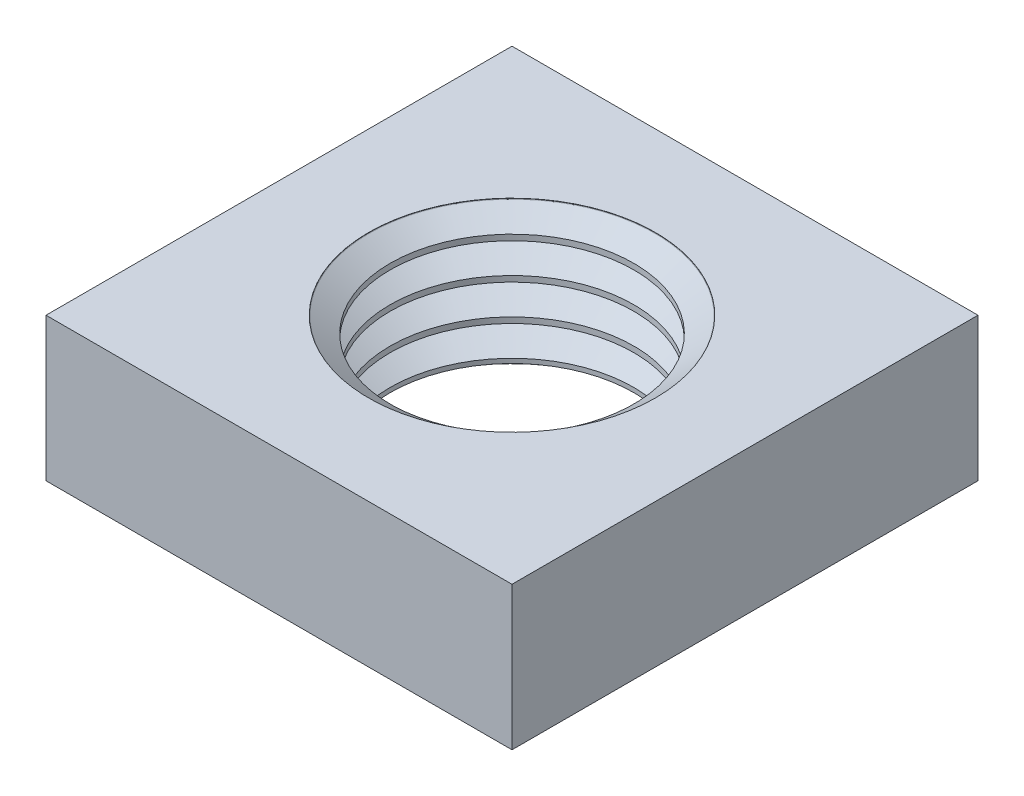
ISO-10303-21;
HEADER;
FILE_DESCRIPTION(('STEP AP214'),'2;1');
FILE_NAME('part.step','',(''),(''),'','','');
FILE_SCHEMA(('AUTOMOTIVE_DESIGN { 1 0 10303 214 1 1 1 1 }'));
ENDSEC;
DATA;
#1=APPLICATION_CONTEXT('core data for automotive mechanical design processes');
#2=APPLICATION_PROTOCOL_DEFINITION('international standard','automotive_design',2000,#1);
#3=PRODUCT_CONTEXT('',#1,'mechanical');
#4=PRODUCT('Part','Part','',(#3));
#5=PRODUCT_RELATED_PRODUCT_CATEGORY('part','',(#4));
#6=PRODUCT_DEFINITION_FORMATION('','',#4);
#7=PRODUCT_DEFINITION_CONTEXT('part definition',#1,'design');
#8=PRODUCT_DEFINITION('design','',#6,#7);
#9=PRODUCT_DEFINITION_SHAPE('','',#8);
#10=(LENGTH_UNIT() NAMED_UNIT(*) SI_UNIT(.MILLI.,.METRE.));
#11=(NAMED_UNIT(*) PLANE_ANGLE_UNIT() SI_UNIT($,.RADIAN.));
#12=(NAMED_UNIT(*) SI_UNIT($,.STERADIAN.) SOLID_ANGLE_UNIT());
#13=UNCERTAINTY_MEASURE_WITH_UNIT(LENGTH_MEASURE(1.E-05),#10,'distance_accuracy_value','');
#14=(GEOMETRIC_REPRESENTATION_CONTEXT(3) GLOBAL_UNCERTAINTY_ASSIGNED_CONTEXT((#13)) GLOBAL_UNIT_ASSIGNED_CONTEXT((#10,
#11,#12)) REPRESENTATION_CONTEXT('',''));
#15=CARTESIAN_POINT('',(0.,0.,0.));
#16=DIRECTION('',(0.,0.,1.));
#17=DIRECTION('',(1.,0.,0.));
#18=AXIS2_PLACEMENT_3D('',#15,#16,#17);
#19=CARTESIAN_POINT('',(0.,-4.,0.));
#20=DIRECTION('',(0.,1.,0.));
#21=DIRECTION('',(1.,0.,0.));
#22=AXIS2_PLACEMENT_3D('',#19,#20,#21);
#23=CYLINDRICAL_SURFACE('',#22,3.4);
#24=CARTESIAN_POINT('',(0.,-3.44402452292583,0.));
#25=DIRECTION('',(0.,-1.,0.));
#26=DIRECTION('',(-1.,0.,0.));
#27=AXIS2_PLACEMENT_3D('',#24,#25,#26);
#28=CIRCLE('',#27,3.4);
#29=CARTESIAN_POINT('',(-3.4,-3.44402452292583,0.));
#30=VERTEX_POINT('',#29);
#31=EDGE_CURVE('E138',#30,#30,#28,.T.);
#32=ORIENTED_EDGE('',*,*,#31,.F.);
#33=EDGE_LOOP('',(#32));
#34=FACE_BOUND('',#33,.T.);
#35=CARTESIAN_POINT('',(0.,-3.57087547707417,0.));
#36=DIRECTION('',(0.,-1.,0.));
#37=DIRECTION('',(-1.,0.,0.));
#38=AXIS2_PLACEMENT_3D('',#35,#36,#37);
#39=CIRCLE('',#38,3.4);
#40=CARTESIAN_POINT('',(-3.4,-3.57087547707417,0.));
#41=VERTEX_POINT('',#40);
#42=EDGE_CURVE('E100',#41,#41,#39,.F.);
#43=ORIENTED_EDGE('',*,*,#42,.F.);
#44=EDGE_LOOP('',(#43));
#45=FACE_BOUND('',#44,.T.);
#46=ADVANCED_FACE('F16',(#34,#45),#23,.F.);
#47=CARTESIAN_POINT('',(0.,-2.60377547707418,0.));
#48=DIRECTION('',(0.,-1.,0.));
#49=DIRECTION('',(-1.,0.,0.));
#50=AXIS2_PLACEMENT_3D('',#47,#48,#49);
#51=CIRCLE('',#50,3.4);
#52=CARTESIAN_POINT('',(-3.4,-2.60377547707418,0.));
#53=VERTEX_POINT('',#52);
#54=EDGE_CURVE('E141',#53,#53,#51,.T.);
#55=ORIENTED_EDGE('',*,*,#54,.T.);
#56=EDGE_LOOP('',(#55));
#57=FACE_BOUND('',#56,.T.);
#58=CARTESIAN_POINT('',(0.,-2.44452452292583,0.));
#59=DIRECTION('',(0.,-1.,0.));
#60=DIRECTION('',(-1.,0.,0.));
#61=AXIS2_PLACEMENT_3D('',#58,#59,#60);
#62=CIRCLE('',#61,3.4);
#63=CARTESIAN_POINT('',(-3.4,-2.44452452292583,0.));
#64=VERTEX_POINT('',#63);
#65=EDGE_CURVE('E129',#64,#64,#62,.T.);
#66=ORIENTED_EDGE('',*,*,#65,.F.);
#67=EDGE_LOOP('',(#66));
#68=FACE_BOUND('',#67,.T.);
#69=ADVANCED_FACE('F145',(#57,#68),#23,.F.);
#70=CARTESIAN_POINT('',(0.,-1.60427547707418,0.));
#71=DIRECTION('',(0.,-1.,0.));
#72=DIRECTION('',(-1.,0.,0.));
#73=AXIS2_PLACEMENT_3D('',#70,#71,#72);
#74=CIRCLE('',#73,3.4);
#75=CARTESIAN_POINT('',(-3.4,-1.60427547707418,0.));
#76=VERTEX_POINT('',#75);
#77=EDGE_CURVE('E132',#76,#76,#74,.T.);
#78=ORIENTED_EDGE('',*,*,#77,.T.);
#79=EDGE_LOOP('',(#78));
#80=FACE_BOUND('',#79,.T.);
#81=CARTESIAN_POINT('',(0.,-1.44502452292583,0.));
#82=DIRECTION('',(0.,-1.,0.));
#83=DIRECTION('',(-1.,0.,0.));
#84=AXIS2_PLACEMENT_3D('',#81,#82,#83);
#85=CIRCLE('',#84,3.4);
#86=CARTESIAN_POINT('',(-3.4,-1.44502452292583,0.));
#87=VERTEX_POINT('',#86);
#88=EDGE_CURVE('E120',#87,#87,#85,.T.);
#89=ORIENTED_EDGE('',*,*,#88,.F.);
#90=EDGE_LOOP('',(#89));
#91=FACE_BOUND('',#90,.T.);
#92=ADVANCED_FACE('F169',(#80,#91),#23,.F.);
#93=CARTESIAN_POINT('',(0.,-0.604775477074183,0.));
#94=DIRECTION('',(0.,-1.,0.));
#95=DIRECTION('',(-1.,0.,0.));
#96=AXIS2_PLACEMENT_3D('',#93,#94,#95);
#97=CIRCLE('',#96,3.4);
#98=CARTESIAN_POINT('',(-3.4,-0.604775477074183,0.));
#99=VERTEX_POINT('',#98);
#100=EDGE_CURVE('E123',#99,#99,#97,.T.);
#101=ORIENTED_EDGE('',*,*,#100,.T.);
#102=EDGE_LOOP('',(#101));
#103=FACE_BOUND('',#102,.T.);
#104=CARTESIAN_POINT('',(0.,-0.445524522925831,0.));
#105=DIRECTION('',(0.,-1.,0.));
#106=DIRECTION('',(-1.,0.,0.));
#107=AXIS2_PLACEMENT_3D('',#104,#105,#106);
#108=CIRCLE('',#107,3.4);
#109=CARTESIAN_POINT('',(-3.4,-0.445524522925831,0.));
#110=VERTEX_POINT('',#109);
#111=EDGE_CURVE('E114',#110,#110,#108,.T.);
#112=ORIENTED_EDGE('',*,*,#111,.F.);
#113=EDGE_LOOP('',(#112));
#114=FACE_BOUND('',#113,.T.);
#115=ADVANCED_FACE('F164',(#103,#114),#23,.F.);
#116=CARTESIAN_POINT('',(-6.5,-4.,6.5));
#117=DIRECTION('',(-1.,0.,0.));
#118=DIRECTION('',(0.,1.,0.));
#119=AXIS2_PLACEMENT_3D('',#116,#117,#118);
#120=PLANE('',#119);
#121=DIRECTION('',(0.,0.,1.));
#122=VECTOR('',#121,1.);
#123=CARTESIAN_POINT('',(-6.5,0.,6.5));
#124=LINE('',#123,#122);
#125=CARTESIAN_POINT('',(-6.5,0.,-6.5));
#126=VERTEX_POINT('',#125);
#127=CARTESIAN_POINT('',(-6.5,0.,6.5));
#128=VERTEX_POINT('',#127);
#129=EDGE_CURVE('E84',#126,#128,#124,.T.);
#130=ORIENTED_EDGE('',*,*,#129,.F.);
#131=DIRECTION('',(0.,1.,0.));
#132=VECTOR('',#131,1.);
#133=CARTESIAN_POINT('',(-6.5,-4.,-6.5));
#134=LINE('',#133,#132);
#135=CARTESIAN_POINT('',(-6.5,-4.,-6.5));
#136=VERTEX_POINT('',#135);
#137=EDGE_CURVE('E10',#136,#126,#134,.T.);
#138=ORIENTED_EDGE('',*,*,#137,.F.);
#139=DIRECTION('',(0.,0.,1.));
#140=VECTOR('',#139,1.);
#141=CARTESIAN_POINT('',(-6.5,-4.,6.5));
#142=LINE('',#141,#140);
#143=CARTESIAN_POINT('',(-6.5,-4.,6.5));
#144=VERTEX_POINT('',#143);
#145=EDGE_CURVE('E77',#136,#144,#142,.T.);
#146=ORIENTED_EDGE('',*,*,#145,.T.);
#147=DIRECTION('',(0.,1.,0.));
#148=VECTOR('',#147,1.);
#149=CARTESIAN_POINT('',(-6.5,-4.,6.5));
#150=LINE('',#149,#148);
#151=EDGE_CURVE('E60',#144,#128,#150,.T.);
#152=ORIENTED_EDGE('',*,*,#151,.T.);
#153=EDGE_LOOP('',(#130,#138,#146,#152));
#154=FACE_BOUND('',#153,.T.);
#155=ADVANCED_FACE('F18',(#154),#120,.T.);
#156=CARTESIAN_POINT('',(-6.5,-4.,-6.5));
#157=DIRECTION('',(0.,0.,-1.));
#158=DIRECTION('',(-1.,0.,0.));
#159=AXIS2_PLACEMENT_3D('',#156,#157,#158);
#160=PLANE('',#159);
#161=DIRECTION('',(-1.,0.,0.));
#162=VECTOR('',#161,1.);
#163=CARTESIAN_POINT('',(-6.5,0.,-6.5));
#164=LINE('',#163,#162);
#165=CARTESIAN_POINT('',(6.5,0.,-6.5));
#166=VERTEX_POINT('',#165);
#167=EDGE_CURVE('E79',#166,#126,#164,.T.);
#168=ORIENTED_EDGE('',*,*,#167,.F.);
#169=DIRECTION('',(0.,1.,0.));
#170=VECTOR('',#169,1.);
#171=CARTESIAN_POINT('',(6.5,-4.,-6.5));
#172=LINE('',#171,#170);
#173=CARTESIAN_POINT('',(6.5,-4.,-6.5));
#174=VERTEX_POINT('',#173);
#175=EDGE_CURVE('E26',#174,#166,#172,.T.);
#176=ORIENTED_EDGE('',*,*,#175,.F.);
#177=DIRECTION('',(-1.,0.,0.));
#178=VECTOR('',#177,1.);
#179=CARTESIAN_POINT('',(-6.5,-4.,-6.5));
#180=LINE('',#179,#178);
#181=EDGE_CURVE('E74',#174,#136,#180,.T.);
#182=ORIENTED_EDGE('',*,*,#181,.T.);
#183=ORIENTED_EDGE('',*,*,#137,.T.);
#184=EDGE_LOOP('',(#168,#176,#182,#183));
#185=FACE_BOUND('',#184,.T.);
#186=ADVANCED_FACE('F178',(#185),#160,.T.);
#187=CARTESIAN_POINT('',(6.5,-4.,6.5));
#188=DIRECTION('',(1.,0.,0.));
#189=DIRECTION('',(0.,0.,-1.));
#190=AXIS2_PLACEMENT_3D('',#187,#188,#189);
#191=PLANE('',#190);
#192=DIRECTION('',(0.,0.,-1.));
#193=VECTOR('',#192,1.);
#194=CARTESIAN_POINT('',(6.5,0.,6.5));
#195=LINE('',#194,#193);
#196=CARTESIAN_POINT('',(6.5,0.,6.5));
#197=VERTEX_POINT('',#196);
#198=EDGE_CURVE('E68',#197,#166,#195,.T.);
#199=ORIENTED_EDGE('',*,*,#198,.F.);
#200=DIRECTION('',(0.,1.,0.));
#201=VECTOR('',#200,1.);
#202=CARTESIAN_POINT('',(6.5,-4.,6.5));
#203=LINE('',#202,#201);
#204=CARTESIAN_POINT('',(6.5,-4.,6.5));
#205=VERTEX_POINT('',#204);
#206=EDGE_CURVE('E63',#205,#197,#203,.T.);
#207=ORIENTED_EDGE('',*,*,#206,.F.);
#208=DIRECTION('',(0.,0.,-1.));
#209=VECTOR('',#208,1.);
#210=CARTESIAN_POINT('',(6.5,-4.,6.5));
#211=LINE('',#210,#209);
#212=EDGE_CURVE('E66',#205,#174,#211,.T.);
#213=ORIENTED_EDGE('',*,*,#212,.T.);
#214=ORIENTED_EDGE('',*,*,#175,.T.);
#215=EDGE_LOOP('',(#199,#207,#213,#214));
#216=FACE_BOUND('',#215,.T.);
#217=ADVANCED_FACE('F65',(#216),#191,.T.);
#218=CARTESIAN_POINT('',(-6.5,-4.,6.5));
#219=DIRECTION('',(0.,0.,1.));
#220=DIRECTION('',(0.,-1.,0.));
#221=AXIS2_PLACEMENT_3D('',#218,#219,#220);
#222=PLANE('',#221);
#223=DIRECTION('',(1.,0.,0.));
#224=VECTOR('',#223,1.);
#225=CARTESIAN_POINT('',(-6.5,0.,6.5));
#226=LINE('',#225,#224);
#227=EDGE_CURVE('E87',#128,#197,#226,.T.);
#228=ORIENTED_EDGE('',*,*,#227,.F.);
#229=ORIENTED_EDGE('',*,*,#151,.F.);
#230=DIRECTION('',(1.,0.,0.));
#231=VECTOR('',#230,1.);
#232=CARTESIAN_POINT('',(-6.5,-4.,6.5));
#233=LINE('',#232,#231);
#234=EDGE_CURVE('E73',#144,#205,#233,.T.);
#235=ORIENTED_EDGE('',*,*,#234,.T.);
#236=ORIENTED_EDGE('',*,*,#206,.T.);
#237=EDGE_LOOP('',(#228,#229,#235,#236));
#238=FACE_BOUND('',#237,.T.);
#239=ADVANCED_FACE('F76',(#238),#222,.T.);
#240=CARTESIAN_POINT('',(-6.5,-4.,6.5));
#241=DIRECTION('',(0.,-1.,0.));
#242=DIRECTION('',(-1.,0.,0.));
#243=AXIS2_PLACEMENT_3D('',#240,#241,#242);
#244=PLANE('',#243);
#245=CARTESIAN_POINT('',(0.,-4.,0.));
#246=DIRECTION('',(0.,-1.,0.));
#247=DIRECTION('',(-1.,0.,0.));
#248=AXIS2_PLACEMENT_3D('',#245,#246,#247);
#249=CIRCLE('',#248,4.);
#250=CARTESIAN_POINT('',(-4.,-4.,0.));
#251=VERTEX_POINT('',#250);
#252=EDGE_CURVE('E98',#251,#251,#249,.F.);
#253=ORIENTED_EDGE('',*,*,#252,.T.);
#254=EDGE_LOOP('',(#253));
#255=FACE_BOUND('',#254,.T.);
#256=ORIENTED_EDGE('',*,*,#145,.F.);
#257=ORIENTED_EDGE('',*,*,#181,.F.);
#258=ORIENTED_EDGE('',*,*,#212,.F.);
#259=ORIENTED_EDGE('',*,*,#234,.F.);
#260=EDGE_LOOP('',(#256,#257,#258,#259));
#261=FACE_BOUND('',#260,.T.);
#262=ADVANCED_FACE('F72',(#255,#261),#244,.T.);
#263=CARTESIAN_POINT('',(-6.5,0.,6.5));
#264=DIRECTION('',(0.,-1.,0.));
#265=DIRECTION('',(-1.,0.,0.));
#266=AXIS2_PLACEMENT_3D('',#263,#264,#265);
#267=PLANE('',#266);
#268=CARTESIAN_POINT('',(0.,0.,0.));
#269=DIRECTION('',(0.,-1.,0.));
#270=DIRECTION('',(-1.,0.,0.));
#271=AXIS2_PLACEMENT_3D('',#268,#269,#270);
#272=CIRCLE('',#271,4.);
#273=CARTESIAN_POINT('',(-4.,0.,0.));
#274=VERTEX_POINT('',#273);
#275=EDGE_CURVE('E88',#274,#274,#272,.F.);
#276=ORIENTED_EDGE('',*,*,#275,.F.);
#277=EDGE_LOOP('',(#276));
#278=FACE_BOUND('',#277,.T.);
#279=ORIENTED_EDGE('',*,*,#129,.T.);
#280=ORIENTED_EDGE('',*,*,#227,.T.);
#281=ORIENTED_EDGE('',*,*,#198,.T.);
#282=ORIENTED_EDGE('',*,*,#167,.T.);
#283=EDGE_LOOP('',(#279,#280,#281,#282));
#284=FACE_BOUND('',#283,.T.);
#285=ADVANCED_FACE('F215',(#278,#284),#267,.F.);
#286=CARTESIAN_POINT('',(0.,-25.0375057290932,0.));
#287=DIRECTION('',(0.,1.,0.));
#288=DIRECTION('',(1.,0.,0.));
#289=AXIS2_PLACEMENT_3D('',#286,#287,#288);
#290=CYLINDRICAL_SURFACE('',#289,4.);
#291=CARTESIAN_POINT('',(0.,-0.00799999999999759,0.));
#292=DIRECTION('',(0.,1.,0.));
#293=DIRECTION('',(1.,0.,0.));
#294=AXIS2_PLACEMENT_3D('',#291,#292,#293);
#295=CIRCLE('',#294,4.);
#296=CARTESIAN_POINT('',(4.,-0.00799999999999781,0.));
#297=VERTEX_POINT('',#296);
#298=EDGE_CURVE('E97',#297,#297,#295,.T.);
#299=ORIENTED_EDGE('',*,*,#298,.F.);
#300=EDGE_LOOP('',(#299));
#301=FACE_BOUND('',#300,.T.);
#302=ORIENTED_EDGE('',*,*,#275,.T.);
#303=EDGE_LOOP('',(#302));
#304=FACE_BOUND('',#303,.T.);
#305=ADVANCED_FACE('F212',(#301,#304),#290,.F.);
#306=CARTESIAN_POINT('',(0.,-0.470136975218409,0.));
#307=DIRECTION('',(0.,1.,0.));
#308=DIRECTION('',(1.,0.,0.));
#309=AXIS2_PLACEMENT_3D('',#306,#307,#308);
#310=CONICAL_SURFACE('',#309,3.34,0.959931088596878);
#311=CARTESIAN_POINT('',(0.,-0.0166999999999984,0.));
#312=DIRECTION('',(0.,-1.,0.));
#313=DIRECTION('',(-1.,0.,0.));
#314=AXIS2_PLACEMENT_3D('',#311,#312,#313);
#315=CIRCLE('',#314,3.98757511234134);
#316=CARTESIAN_POINT('',(-3.98757511234134,-0.0166999999999982,0.));
#317=VERTEX_POINT('',#316);
#318=EDGE_CURVE('E20',#317,#317,#315,.F.);
#319=ORIENTED_EDGE('',*,*,#318,.F.);
#320=EDGE_LOOP('',(#319));
#321=FACE_BOUND('',#320,.T.);
#322=ORIENTED_EDGE('',*,*,#298,.T.);
#323=EDGE_LOOP('',(#322));
#324=FACE_BOUND('',#323,.T.);
#325=ADVANCED_FACE('F206',(#321,#324),#310,.F.);
#326=CARTESIAN_POINT('',(0.,-3.991,0.));
#327=DIRECTION('',(0.,-1.,0.));
#328=DIRECTION('',(-1.,0.,0.));
#329=AXIS2_PLACEMENT_3D('',#326,#327,#328);
#330=CONICAL_SURFACE('',#329,4.,0.959931088596882);
#331=CARTESIAN_POINT('',(0.,-3.991,0.));
#332=DIRECTION('',(0.,1.,0.));
#333=DIRECTION('',(1.,0.,0.));
#334=AXIS2_PLACEMENT_3D('',#331,#332,#333);
#335=CIRCLE('',#334,4.);
#336=CARTESIAN_POINT('',(4.,-3.991,0.));
#337=VERTEX_POINT('',#336);
#338=EDGE_CURVE('E101',#337,#337,#335,.T.);
#339=ORIENTED_EDGE('',*,*,#338,.F.);
#340=EDGE_LOOP('',(#339));
#341=FACE_BOUND('',#340,.T.);
#342=ORIENTED_EDGE('',*,*,#42,.T.);
#343=EDGE_LOOP('',(#342));
#344=FACE_BOUND('',#343,.T.);
#345=ADVANCED_FACE('F203',(#341,#344),#330,.F.);
#346=CARTESIAN_POINT('',(0.,-25.0375057290932,0.));
#347=DIRECTION('',(0.,1.,0.));
#348=DIRECTION('',(1.,0.,0.));
#349=AXIS2_PLACEMENT_3D('',#346,#347,#348);
#350=CYLINDRICAL_SURFACE('',#349,4.);
#351=ORIENTED_EDGE('',*,*,#252,.F.);
#352=EDGE_LOOP('',(#351));
#353=FACE_BOUND('',#352,.T.);
#354=ORIENTED_EDGE('',*,*,#338,.T.);
#355=EDGE_LOOP('',(#354));
#356=FACE_BOUND('',#355,.T.);
#357=ADVANCED_FACE('F197',(#353,#356),#350,.F.);
#358=CARTESIAN_POINT('',(0.,-0.0254,0.));
#359=DIRECTION('',(0.,-1.,0.));
#360=DIRECTION('',(-1.,0.,0.));
#361=AXIS2_PLACEMENT_3D('',#358,#359,#360);
#362=CONICAL_SURFACE('',#361,4.,0.959931088596891);
#363=ORIENTED_EDGE('',*,*,#318,.T.);
#364=EDGE_LOOP('',(#363));
#365=FACE_BOUND('',#364,.T.);
#366=CARTESIAN_POINT('',(0.,-0.0254,0.));
#367=DIRECTION('',(0.,-1.,0.));
#368=DIRECTION('',(-1.,0.,0.));
#369=AXIS2_PLACEMENT_3D('',#366,#367,#368);
#370=CIRCLE('',#369,4.);
#371=CARTESIAN_POINT('',(-4.,-0.0253999999999997,0.));
#372=VERTEX_POINT('',#371);
#373=EDGE_CURVE('E111',#372,#372,#370,.T.);
#374=ORIENTED_EDGE('',*,*,#373,.T.);
#375=EDGE_LOOP('',(#374));
#376=FACE_BOUND('',#375,.T.);
#377=ADVANCED_FACE('F187',(#365,#376),#362,.F.);
#378=CARTESIAN_POINT('',(0.,-0.445524522925831,0.));
#379=DIRECTION('',(0.,1.,0.));
#380=DIRECTION('',(1.,0.,0.));
#381=AXIS2_PLACEMENT_3D('',#378,#379,#380);
#382=CONICAL_SURFACE('',#381,3.4,0.959931088596875);
#383=ORIENTED_EDGE('',*,*,#373,.F.);
#384=EDGE_LOOP('',(#383));
#385=FACE_BOUND('',#384,.T.);
#386=ORIENTED_EDGE('',*,*,#111,.T.);
#387=EDGE_LOOP('',(#386));
#388=FACE_BOUND('',#387,.T.);
#389=ADVANCED_FACE('F184',(#385,#388),#382,.F.);
#390=CARTESIAN_POINT('',(0.,-1.0249,0.));
#391=DIRECTION('',(0.,-1.,0.));
#392=DIRECTION('',(-1.,0.,0.));
#393=AXIS2_PLACEMENT_3D('',#390,#391,#392);
#394=CONICAL_SURFACE('',#393,4.,0.959931088596891);
#395=ORIENTED_EDGE('',*,*,#100,.F.);
#396=EDGE_LOOP('',(#395));
#397=FACE_BOUND('',#396,.T.);
#398=CARTESIAN_POINT('',(0.,-1.0249,0.));
#399=DIRECTION('',(0.,-1.,0.));
#400=DIRECTION('',(-1.,0.,0.));
#401=AXIS2_PLACEMENT_3D('',#398,#399,#400);
#402=CIRCLE('',#401,4.);
#403=CARTESIAN_POINT('',(-4.,-1.0249,0.));
#404=VERTEX_POINT('',#403);
#405=EDGE_CURVE('E117',#404,#404,#402,.T.);
#406=ORIENTED_EDGE('',*,*,#405,.T.);
#407=EDGE_LOOP('',(#406));
#408=FACE_BOUND('',#407,.T.);
#409=ADVANCED_FACE('F186',(#397,#408),#394,.F.);
#410=CARTESIAN_POINT('',(0.,-1.44502452292583,0.));
#411=DIRECTION('',(0.,1.,0.));
#412=DIRECTION('',(1.,0.,0.));
#413=AXIS2_PLACEMENT_3D('',#410,#411,#412);
#414=CONICAL_SURFACE('',#413,3.4,0.959931088596875);
#415=ORIENTED_EDGE('',*,*,#405,.F.);
#416=EDGE_LOOP('',(#415));
#417=FACE_BOUND('',#416,.T.);
#418=ORIENTED_EDGE('',*,*,#88,.T.);
#419=EDGE_LOOP('',(#418));
#420=FACE_BOUND('',#419,.T.);
#421=ADVANCED_FACE('F194',(#417,#420),#414,.F.);
#422=CARTESIAN_POINT('',(0.,-2.0244,0.));
#423=DIRECTION('',(0.,-1.,0.));
#424=DIRECTION('',(-1.,0.,0.));
#425=AXIS2_PLACEMENT_3D('',#422,#423,#424);
#426=CONICAL_SURFACE('',#425,4.,0.959931088596891);
#427=ORIENTED_EDGE('',*,*,#77,.F.);
#428=EDGE_LOOP('',(#427));
#429=FACE_BOUND('',#428,.T.);
#430=CARTESIAN_POINT('',(0.,-2.0244,0.));
#431=DIRECTION('',(0.,-1.,0.));
#432=DIRECTION('',(-1.,0.,0.));
#433=AXIS2_PLACEMENT_3D('',#430,#431,#432);
#434=CIRCLE('',#433,4.);
#435=CARTESIAN_POINT('',(-4.,-2.0244,0.));
#436=VERTEX_POINT('',#435);
#437=EDGE_CURVE('E126',#436,#436,#434,.T.);
#438=ORIENTED_EDGE('',*,*,#437,.T.);
#439=EDGE_LOOP('',(#438));
#440=FACE_BOUND('',#439,.T.);
#441=ADVANCED_FACE('F297',(#429,#440),#426,.F.);
#442=CARTESIAN_POINT('',(0.,-2.44452452292583,0.));
#443=DIRECTION('',(0.,1.,0.));
#444=DIRECTION('',(1.,0.,0.));
#445=AXIS2_PLACEMENT_3D('',#442,#443,#444);
#446=CONICAL_SURFACE('',#445,3.4,0.959931088596875);
#447=ORIENTED_EDGE('',*,*,#437,.F.);
#448=EDGE_LOOP('',(#447));
#449=FACE_BOUND('',#448,.T.);
#450=ORIENTED_EDGE('',*,*,#65,.T.);
#451=EDGE_LOOP('',(#450));
#452=FACE_BOUND('',#451,.T.);
#453=ADVANCED_FACE('F152',(#449,#452),#446,.F.);
#454=CARTESIAN_POINT('',(0.,-3.0239,0.));
#455=DIRECTION('',(0.,-1.,0.));
#456=DIRECTION('',(-1.,0.,0.));
#457=AXIS2_PLACEMENT_3D('',#454,#455,#456);
#458=CONICAL_SURFACE('',#457,4.,0.959931088596891);
#459=ORIENTED_EDGE('',*,*,#54,.F.);
#460=EDGE_LOOP('',(#459));
#461=FACE_BOUND('',#460,.T.);
#462=CARTESIAN_POINT('',(0.,-3.0239,0.));
#463=DIRECTION('',(0.,-1.,0.));
#464=DIRECTION('',(-1.,0.,0.));
#465=AXIS2_PLACEMENT_3D('',#462,#463,#464);
#466=CIRCLE('',#465,4.);
#467=CARTESIAN_POINT('',(-4.,-3.0239,0.));
#468=VERTEX_POINT('',#467);
#469=EDGE_CURVE('E135',#468,#468,#466,.T.);
#470=ORIENTED_EDGE('',*,*,#469,.T.);
#471=EDGE_LOOP('',(#470));
#472=FACE_BOUND('',#471,.T.);
#473=ADVANCED_FACE('F148',(#461,#472),#458,.F.);
#474=CARTESIAN_POINT('',(0.,-3.44402452292583,0.));
#475=DIRECTION('',(0.,1.,0.));
#476=DIRECTION('',(1.,0.,0.));
#477=AXIS2_PLACEMENT_3D('',#474,#475,#476);
#478=CONICAL_SURFACE('',#477,3.4,0.959931088596875);
#479=ORIENTED_EDGE('',*,*,#469,.F.);
#480=EDGE_LOOP('',(#479));
#481=FACE_BOUND('',#480,.T.);
#482=ORIENTED_EDGE('',*,*,#31,.T.);
#483=EDGE_LOOP('',(#482));
#484=FACE_BOUND('',#483,.T.);
#485=ADVANCED_FACE('F151',(#481,#484),#478,.F.);
#486=CLOSED_SHELL('',(#46,#69,#92,#115,#155,#186,#217,#239,#262,#285,#305,#325,#345,#357,#377,
#389,#409,#421,#441,#453,#473,#485));
#487=MANIFOLD_SOLID_BREP('B1',#486);
#488=ADVANCED_BREP_SHAPE_REPRESENTATION('',(#18,#487),#14);
#489=SHAPE_DEFINITION_REPRESENTATION(#9,#488);
ENDSEC;
END-ISO-10303-21;
